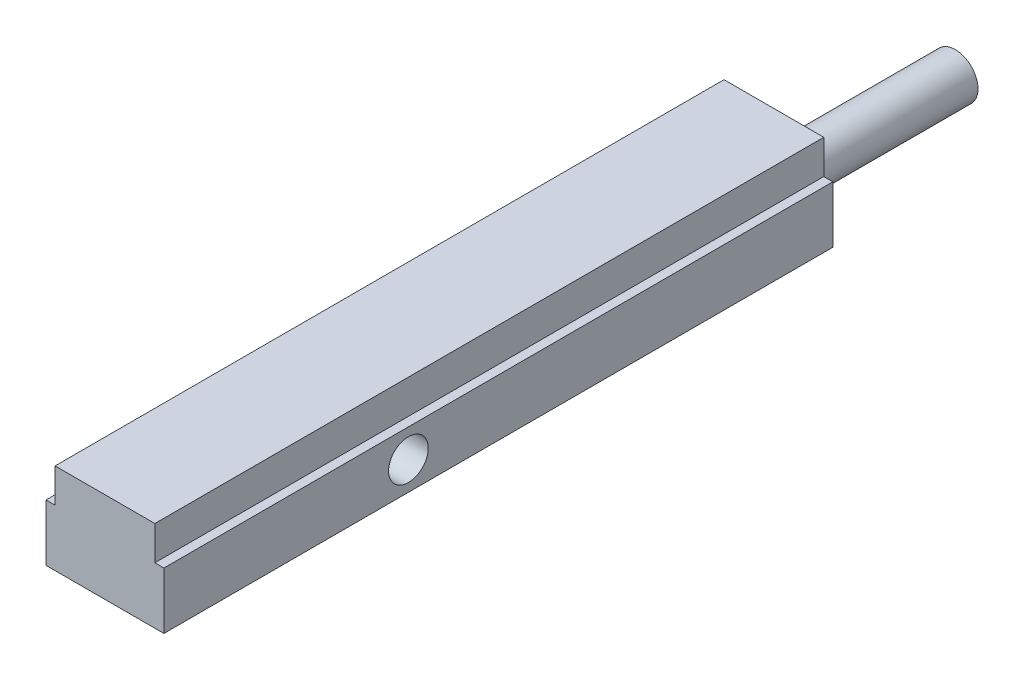
ISO-10303-21;
HEADER;
FILE_DESCRIPTION(('STEP AP214'),'2;1');
FILE_NAME('part.step','',(''),(''),'','','');
FILE_SCHEMA(('AUTOMOTIVE_DESIGN { 1 0 10303 214 1 1 1 1 }'));
ENDSEC;
DATA;
#1=APPLICATION_CONTEXT('core data for automotive mechanical design processes');
#2=APPLICATION_PROTOCOL_DEFINITION('international standard','automotive_design',2000,#1);
#3=PRODUCT_CONTEXT('',#1,'mechanical');
#4=PRODUCT('Part','Part','',(#3));
#5=PRODUCT_RELATED_PRODUCT_CATEGORY('part','',(#4));
#6=PRODUCT_DEFINITION_FORMATION('','',#4);
#7=PRODUCT_DEFINITION_CONTEXT('part definition',#1,'design');
#8=PRODUCT_DEFINITION('design','',#6,#7);
#9=PRODUCT_DEFINITION_SHAPE('','',#8);
#10=(LENGTH_UNIT() NAMED_UNIT(*) SI_UNIT(.MILLI.,.METRE.));
#11=(NAMED_UNIT(*) PLANE_ANGLE_UNIT() SI_UNIT($,.RADIAN.));
#12=(NAMED_UNIT(*) SI_UNIT($,.STERADIAN.) SOLID_ANGLE_UNIT());
#13=UNCERTAINTY_MEASURE_WITH_UNIT(LENGTH_MEASURE(1.E-05),#10,'distance_accuracy_value','');
#14=(GEOMETRIC_REPRESENTATION_CONTEXT(3) GLOBAL_UNCERTAINTY_ASSIGNED_CONTEXT((#13)) GLOBAL_UNIT_ASSIGNED_CONTEXT((#10,
#11,#12)) REPRESENTATION_CONTEXT('',''));
#15=CARTESIAN_POINT('',(0.,0.,0.));
#16=DIRECTION('',(0.,0.,1.));
#17=DIRECTION('',(1.,0.,0.));
#18=AXIS2_PLACEMENT_3D('',#15,#16,#17);
#19=CARTESIAN_POINT('',(-26.,0.,295.));
#20=DIRECTION('',(-1.,0.,0.));
#21=DIRECTION('',(0.,0.,1.));
#22=AXIS2_PLACEMENT_3D('',#19,#20,#21);
#23=PLANE('',#22);
#24=CARTESIAN_POINT('',(-26.,0.,187.17));
#25=DIRECTION('',(-1.,0.,0.));
#26=DIRECTION('',(0.,0.,1.));
#27=AXIS2_PLACEMENT_3D('',#24,#25,#26);
#28=CIRCLE('',#27,10.025);
#29=CARTESIAN_POINT('',(-26.,0.,197.195));
#30=VERTEX_POINT('',#29);
#31=EDGE_CURVE('E204',#30,#30,#28,.T.);
#32=ORIENTED_EDGE('',*,*,#31,.F.);
#33=EDGE_LOOP('',(#32));
#34=FACE_BOUND('',#33,.T.);
#35=DIRECTION('',(0.,1.,0.));
#36=VECTOR('',#35,1.);
#37=CARTESIAN_POINT('',(-26.,0.,0.));
#38=LINE('',#37,#36);
#39=CARTESIAN_POINT('',(-26.,-12.5,0.));
#40=VERTEX_POINT('',#39);
#41=CARTESIAN_POINT('',(-26.,12.5,0.));
#42=VERTEX_POINT('',#41);
#43=EDGE_CURVE('E133',#40,#42,#38,.T.);
#44=ORIENTED_EDGE('',*,*,#43,.F.);
#45=DIRECTION('',(0.,0.,-1.));
#46=VECTOR('',#45,1.);
#47=CARTESIAN_POINT('',(-26.,-12.5,295.));
#48=LINE('',#47,#46);
#49=CARTESIAN_POINT('',(-26.,-12.5,295.));
#50=VERTEX_POINT('',#49);
#51=EDGE_CURVE('E11',#50,#40,#48,.T.);
#52=ORIENTED_EDGE('',*,*,#51,.F.);
#53=DIRECTION('',(0.,1.,0.));
#54=VECTOR('',#53,1.);
#55=CARTESIAN_POINT('',(-26.,0.,295.));
#56=LINE('',#55,#54);
#57=CARTESIAN_POINT('',(-26.,12.5,295.));
#58=VERTEX_POINT('',#57);
#59=EDGE_CURVE('E174',#50,#58,#56,.T.);
#60=ORIENTED_EDGE('',*,*,#59,.T.);
#61=DIRECTION('',(0.,0.,-1.));
#62=VECTOR('',#61,1.);
#63=CARTESIAN_POINT('',(-26.,12.5,295.));
#64=LINE('',#63,#62);
#65=EDGE_CURVE('E89',#58,#42,#64,.T.);
#66=ORIENTED_EDGE('',*,*,#65,.T.);
#67=EDGE_LOOP('',(#44,#52,#60,#66));
#68=FACE_BOUND('',#67,.T.);
#69=ADVANCED_FACE('F39',(#34,#68),#23,.T.);
#70=CARTESIAN_POINT('',(0.,-12.5,295.));
#71=DIRECTION('',(0.,-1.,0.));
#72=DIRECTION('',(1.,0.,0.));
#73=AXIS2_PLACEMENT_3D('',#70,#71,#72);
#74=PLANE('',#73);
#75=DIRECTION('',(-1.,0.,0.));
#76=VECTOR('',#75,1.);
#77=CARTESIAN_POINT('',(0.,-12.5,0.));
#78=LINE('',#77,#76);
#79=CARTESIAN_POINT('',(26.,-12.5,0.));
#80=VERTEX_POINT('',#79);
#81=EDGE_CURVE('E136',#80,#40,#78,.T.);
#82=ORIENTED_EDGE('',*,*,#81,.F.);
#83=DIRECTION('',(0.,0.,-1.));
#84=VECTOR('',#83,1.);
#85=CARTESIAN_POINT('',(26.,-12.5,295.));
#86=LINE('',#85,#84);
#87=CARTESIAN_POINT('',(26.,-12.5,295.));
#88=VERTEX_POINT('',#87);
#89=EDGE_CURVE('E47',#88,#80,#86,.T.);
#90=ORIENTED_EDGE('',*,*,#89,.F.);
#91=DIRECTION('',(-1.,0.,0.));
#92=VECTOR('',#91,1.);
#93=CARTESIAN_POINT('',(0.,-12.5,295.));
#94=LINE('',#93,#92);
#95=EDGE_CURVE('E173',#88,#50,#94,.T.);
#96=ORIENTED_EDGE('',*,*,#95,.T.);
#97=ORIENTED_EDGE('',*,*,#51,.T.);
#98=EDGE_LOOP('',(#82,#90,#96,#97));
#99=FACE_BOUND('',#98,.T.);
#100=ADVANCED_FACE('F172',(#99),#74,.T.);
#101=CARTESIAN_POINT('',(26.,0.,295.));
#102=DIRECTION('',(-1.,0.,0.));
#103=DIRECTION('',(0.,0.,1.));
#104=AXIS2_PLACEMENT_3D('',#101,#102,#103);
#105=PLANE('',#104);
#106=CARTESIAN_POINT('',(26.,0.,187.17));
#107=DIRECTION('',(-1.,0.,0.));
#108=DIRECTION('',(0.,0.,1.));
#109=AXIS2_PLACEMENT_3D('',#106,#107,#108);
#110=CIRCLE('',#109,8.74999999999998);
#111=CARTESIAN_POINT('',(26.,0.,195.92));
#112=VERTEX_POINT('',#111);
#113=EDGE_CURVE('E209',#112,#112,#110,.T.);
#114=ORIENTED_EDGE('',*,*,#113,.T.);
#115=EDGE_LOOP('',(#114));
#116=FACE_BOUND('',#115,.T.);
#117=DIRECTION('',(0.,1.,0.));
#118=VECTOR('',#117,1.);
#119=CARTESIAN_POINT('',(26.,0.,0.));
#120=LINE('',#119,#118);
#121=CARTESIAN_POINT('',(26.,12.5,0.));
#122=VERTEX_POINT('',#121);
#123=EDGE_CURVE('E140',#80,#122,#120,.T.);
#124=ORIENTED_EDGE('',*,*,#123,.T.);
#125=DIRECTION('',(0.,0.,-1.));
#126=VECTOR('',#125,1.);
#127=CARTESIAN_POINT('',(26.,12.5,295.));
#128=LINE('',#127,#126);
#129=CARTESIAN_POINT('',(26.,12.5,295.));
#130=VERTEX_POINT('',#129);
#131=EDGE_CURVE('E156',#130,#122,#128,.T.);
#132=ORIENTED_EDGE('',*,*,#131,.F.);
#133=DIRECTION('',(0.,1.,0.));
#134=VECTOR('',#133,1.);
#135=CARTESIAN_POINT('',(26.,0.,295.));
#136=LINE('',#135,#134);
#137=EDGE_CURVE('E163',#88,#130,#136,.T.);
#138=ORIENTED_EDGE('',*,*,#137,.F.);
#139=ORIENTED_EDGE('',*,*,#89,.T.);
#140=EDGE_LOOP('',(#124,#132,#138,#139));
#141=FACE_BOUND('',#140,.T.);
#142=ADVANCED_FACE('F161',(#116,#141),#105,.F.);
#143=CARTESIAN_POINT('',(0.,12.5,295.));
#144=DIRECTION('',(0.,-1.,0.));
#145=DIRECTION('',(1.,0.,0.));
#146=AXIS2_PLACEMENT_3D('',#143,#144,#145);
#147=PLANE('',#146);
#148=DIRECTION('',(-1.,0.,0.));
#149=VECTOR('',#148,1.);
#150=CARTESIAN_POINT('',(0.,12.5,0.));
#151=LINE('',#150,#149);
#152=CARTESIAN_POINT('',(22.,12.5,0.));
#153=VERTEX_POINT('',#152);
#154=EDGE_CURVE('E142',#122,#153,#151,.T.);
#155=ORIENTED_EDGE('',*,*,#154,.T.);
#156=DIRECTION('',(0.,0.,-1.));
#157=VECTOR('',#156,1.);
#158=CARTESIAN_POINT('',(22.,12.5,295.));
#159=LINE('',#158,#157);
#160=CARTESIAN_POINT('',(22.,12.5,295.));
#161=VERTEX_POINT('',#160);
#162=EDGE_CURVE('E153',#161,#153,#159,.T.);
#163=ORIENTED_EDGE('',*,*,#162,.F.);
#164=DIRECTION('',(-1.,0.,0.));
#165=VECTOR('',#164,1.);
#166=CARTESIAN_POINT('',(0.,12.5,295.));
#167=LINE('',#166,#165);
#168=EDGE_CURVE('E130',#130,#161,#167,.T.);
#169=ORIENTED_EDGE('',*,*,#168,.F.);
#170=ORIENTED_EDGE('',*,*,#131,.T.);
#171=EDGE_LOOP('',(#155,#163,#169,#170));
#172=FACE_BOUND('',#171,.T.);
#173=ADVANCED_FACE('F184',(#172),#147,.F.);
#174=CARTESIAN_POINT('',(22.,0.,295.));
#175=DIRECTION('',(-1.,0.,0.));
#176=DIRECTION('',(0.,0.,1.));
#177=AXIS2_PLACEMENT_3D('',#174,#175,#176);
#178=PLANE('',#177);
#179=DIRECTION('',(0.,1.,0.));
#180=VECTOR('',#179,1.);
#181=CARTESIAN_POINT('',(22.,0.,0.));
#182=LINE('',#181,#180);
#183=CARTESIAN_POINT('',(22.,27.5,0.));
#184=VERTEX_POINT('',#183);
#185=EDGE_CURVE('E144',#153,#184,#182,.T.);
#186=ORIENTED_EDGE('',*,*,#185,.T.);
#187=DIRECTION('',(0.,0.,-1.));
#188=VECTOR('',#187,1.);
#189=CARTESIAN_POINT('',(22.,27.5,295.));
#190=LINE('',#189,#188);
#191=CARTESIAN_POINT('',(22.,27.5,295.));
#192=VERTEX_POINT('',#191);
#193=EDGE_CURVE('E125',#192,#184,#190,.T.);
#194=ORIENTED_EDGE('',*,*,#193,.F.);
#195=DIRECTION('',(0.,1.,0.));
#196=VECTOR('',#195,1.);
#197=CARTESIAN_POINT('',(22.,0.,295.));
#198=LINE('',#197,#196);
#199=EDGE_CURVE('E112',#161,#192,#198,.T.);
#200=ORIENTED_EDGE('',*,*,#199,.F.);
#201=ORIENTED_EDGE('',*,*,#162,.T.);
#202=EDGE_LOOP('',(#186,#194,#200,#201));
#203=FACE_BOUND('',#202,.T.);
#204=ADVANCED_FACE('F186',(#203),#178,.F.);
#205=CARTESIAN_POINT('',(0.,27.5,295.));
#206=DIRECTION('',(0.,-1.,0.));
#207=DIRECTION('',(0.,0.,-1.));
#208=AXIS2_PLACEMENT_3D('',#205,#206,#207);
#209=PLANE('',#208);
#210=DIRECTION('',(-1.,0.,0.));
#211=VECTOR('',#210,1.);
#212=CARTESIAN_POINT('',(0.,27.5,0.));
#213=LINE('',#212,#211);
#214=CARTESIAN_POINT('',(-22.,27.5,0.));
#215=VERTEX_POINT('',#214);
#216=EDGE_CURVE('E121',#184,#215,#213,.T.);
#217=ORIENTED_EDGE('',*,*,#216,.T.);
#218=DIRECTION('',(0.,0.,-1.));
#219=VECTOR('',#218,1.);
#220=CARTESIAN_POINT('',(-22.,27.5,295.));
#221=LINE('',#220,#219);
#222=CARTESIAN_POINT('',(-22.,27.5,295.));
#223=VERTEX_POINT('',#222);
#224=EDGE_CURVE('E118',#223,#215,#221,.T.);
#225=ORIENTED_EDGE('',*,*,#224,.F.);
#226=DIRECTION('',(-1.,0.,0.));
#227=VECTOR('',#226,1.);
#228=CARTESIAN_POINT('',(0.,27.5,295.));
#229=LINE('',#228,#227);
#230=EDGE_CURVE('E106',#192,#223,#229,.T.);
#231=ORIENTED_EDGE('',*,*,#230,.F.);
#232=ORIENTED_EDGE('',*,*,#193,.T.);
#233=EDGE_LOOP('',(#217,#225,#231,#232));
#234=FACE_BOUND('',#233,.T.);
#235=ADVANCED_FACE('F119',(#234),#209,.F.);
#236=CARTESIAN_POINT('',(-22.,0.,295.));
#237=DIRECTION('',(-1.,0.,0.));
#238=DIRECTION('',(0.,0.,1.));
#239=AXIS2_PLACEMENT_3D('',#236,#237,#238);
#240=PLANE('',#239);
#241=DIRECTION('',(0.,1.,0.));
#242=VECTOR('',#241,1.);
#243=CARTESIAN_POINT('',(-22.,0.,0.));
#244=LINE('',#243,#242);
#245=CARTESIAN_POINT('',(-22.,12.5,0.));
#246=VERTEX_POINT('',#245);
#247=EDGE_CURVE('E148',#246,#215,#244,.T.);
#248=ORIENTED_EDGE('',*,*,#247,.F.);
#249=DIRECTION('',(0.,0.,-1.));
#250=VECTOR('',#249,1.);
#251=CARTESIAN_POINT('',(-22.,12.5,295.));
#252=LINE('',#251,#250);
#253=CARTESIAN_POINT('',(-22.,12.5,295.));
#254=VERTEX_POINT('',#253);
#255=EDGE_CURVE('E82',#254,#246,#252,.T.);
#256=ORIENTED_EDGE('',*,*,#255,.F.);
#257=DIRECTION('',(0.,1.,0.));
#258=VECTOR('',#257,1.);
#259=CARTESIAN_POINT('',(-22.,0.,295.));
#260=LINE('',#259,#258);
#261=EDGE_CURVE('E110',#254,#223,#260,.T.);
#262=ORIENTED_EDGE('',*,*,#261,.T.);
#263=ORIENTED_EDGE('',*,*,#224,.T.);
#264=EDGE_LOOP('',(#248,#256,#262,#263));
#265=FACE_BOUND('',#264,.T.);
#266=ADVANCED_FACE('F127',(#265),#240,.T.);
#267=EDGE_CURVE('E145',#246,#42,#151,.T.);
#268=ORIENTED_EDGE('',*,*,#267,.T.);
#269=ORIENTED_EDGE('',*,*,#65,.F.);
#270=EDGE_CURVE('E55',#254,#58,#167,.T.);
#271=ORIENTED_EDGE('',*,*,#270,.F.);
#272=ORIENTED_EDGE('',*,*,#255,.T.);
#273=EDGE_LOOP('',(#268,#269,#271,#272));
#274=FACE_BOUND('',#273,.T.);
#275=ADVANCED_FACE('F195',(#274),#147,.F.);
#276=CARTESIAN_POINT('',(0.,0.,295.));
#277=DIRECTION('',(0.,0.,1.));
#278=DIRECTION('',(1.,0.,0.));
#279=AXIS2_PLACEMENT_3D('',#276,#277,#278);
#280=PLANE('',#279);
#281=ORIENTED_EDGE('',*,*,#59,.F.);
#282=ORIENTED_EDGE('',*,*,#95,.F.);
#283=ORIENTED_EDGE('',*,*,#137,.T.);
#284=ORIENTED_EDGE('',*,*,#168,.T.);
#285=ORIENTED_EDGE('',*,*,#199,.T.);
#286=ORIENTED_EDGE('',*,*,#230,.T.);
#287=ORIENTED_EDGE('',*,*,#261,.F.);
#288=ORIENTED_EDGE('',*,*,#270,.T.);
#289=EDGE_LOOP('',(#281,#282,#283,#284,#285,#286,#287,#288));
#290=FACE_BOUND('',#289,.T.);
#291=ADVANCED_FACE('F108',(#290),#280,.T.);
#292=CARTESIAN_POINT('',(0.,0.,0.));
#293=DIRECTION('',(0.,0.,1.));
#294=DIRECTION('',(1.,0.,0.));
#295=AXIS2_PLACEMENT_3D('',#292,#293,#294);
#296=PLANE('',#295);
#297=CARTESIAN_POINT('',(0.,0.,0.));
#298=DIRECTION('',(0.,0.,1.));
#299=DIRECTION('',(1.,0.,0.));
#300=AXIS2_PLACEMENT_3D('',#297,#298,#299);
#301=CIRCLE('',#300,10.);
#302=CARTESIAN_POINT('',(10.,0.,0.));
#303=VERTEX_POINT('',#302);
#304=EDGE_CURVE('E178',#303,#303,#301,.T.);
#305=ORIENTED_EDGE('',*,*,#304,.T.);
#306=EDGE_LOOP('',(#305));
#307=FACE_BOUND('',#306,.T.);
#308=ORIENTED_EDGE('',*,*,#43,.T.);
#309=ORIENTED_EDGE('',*,*,#267,.F.);
#310=ORIENTED_EDGE('',*,*,#247,.T.);
#311=ORIENTED_EDGE('',*,*,#216,.F.);
#312=ORIENTED_EDGE('',*,*,#185,.F.);
#313=ORIENTED_EDGE('',*,*,#154,.F.);
#314=ORIENTED_EDGE('',*,*,#123,.F.);
#315=ORIENTED_EDGE('',*,*,#81,.T.);
#316=EDGE_LOOP('',(#308,#309,#310,#311,#312,#313,#314,#315));
#317=FACE_BOUND('',#316,.T.);
#318=ADVANCED_FACE('F170',(#307,#317),#296,.F.);
#319=CARTESIAN_POINT('',(0.,0.,-80.));
#320=DIRECTION('',(0.,0.,1.));
#321=DIRECTION('',(1.,0.,0.));
#322=AXIS2_PLACEMENT_3D('',#319,#320,#321);
#323=CYLINDRICAL_SURFACE('',#322,10.);
#324=CARTESIAN_POINT('',(0.,0.,-80.));
#325=DIRECTION('',(0.,0.,1.));
#326=DIRECTION('',(1.,0.,0.));
#327=AXIS2_PLACEMENT_3D('',#324,#325,#326);
#328=CIRCLE('',#327,10.);
#329=CARTESIAN_POINT('',(10.,0.,-80.));
#330=VERTEX_POINT('',#329);
#331=EDGE_CURVE('E137',#330,#330,#328,.T.);
#332=ORIENTED_EDGE('',*,*,#331,.T.);
#333=EDGE_LOOP('',(#332));
#334=FACE_BOUND('',#333,.T.);
#335=ORIENTED_EDGE('',*,*,#304,.F.);
#336=EDGE_LOOP('',(#335));
#337=FACE_BOUND('',#336,.T.);
#338=ADVANCED_FACE('F220',(#334,#337),#323,.T.);
#339=CARTESIAN_POINT('',(0.,0.,-80.));
#340=DIRECTION('',(0.,0.,1.));
#341=DIRECTION('',(1.,0.,0.));
#342=AXIS2_PLACEMENT_3D('',#339,#340,#341);
#343=PLANE('',#342);
#344=ORIENTED_EDGE('',*,*,#331,.F.);
#345=EDGE_LOOP('',(#344));
#346=FACE_BOUND('',#345,.T.);
#347=ADVANCED_FACE('F222',(#346),#343,.F.);
#348=CARTESIAN_POINT('',(-26.,0.,187.17));
#349=DIRECTION('',(-1.,0.,0.));
#350=DIRECTION('',(0.,0.,1.));
#351=AXIS2_PLACEMENT_3D('',#348,#349,#350);
#352=CYLINDRICAL_SURFACE('',#351,8.74999999999998);
#353=ORIENTED_EDGE('',*,*,#113,.F.);
#354=EDGE_LOOP('',(#353));
#355=FACE_BOUND('',#354,.T.);
#356=CARTESIAN_POINT('',(-24.725,0.,187.17));
#357=DIRECTION('',(-1.,0.,0.));
#358=DIRECTION('',(0.,0.,1.));
#359=AXIS2_PLACEMENT_3D('',#356,#357,#358);
#360=CIRCLE('',#359,8.74999999999999);
#361=CARTESIAN_POINT('',(-24.725,0.,195.92));
#362=VERTEX_POINT('',#361);
#363=EDGE_CURVE('E206',#362,#362,#360,.T.);
#364=ORIENTED_EDGE('',*,*,#363,.T.);
#365=EDGE_LOOP('',(#364));
#366=FACE_BOUND('',#365,.T.);
#367=ADVANCED_FACE('F228',(#355,#366),#352,.F.);
#368=CARTESIAN_POINT('',(-26.,0.,187.17));
#369=DIRECTION('',(-1.,0.,0.));
#370=DIRECTION('',(0.,0.,1.));
#371=AXIS2_PLACEMENT_3D('',#368,#369,#370);
#372=CONICAL_SURFACE('',#371,10.025,0.785398163397444);
#373=ORIENTED_EDGE('',*,*,#363,.F.);
#374=EDGE_LOOP('',(#373));
#375=FACE_BOUND('',#374,.T.);
#376=ORIENTED_EDGE('',*,*,#31,.T.);
#377=EDGE_LOOP('',(#376));
#378=FACE_BOUND('',#377,.T.);
#379=ADVANCED_FACE('F294',(#375,#378),#372,.F.);
#380=CLOSED_SHELL('',(#69,#100,#142,#173,#204,#235,#266,#275,#291,#318,#338,#347,#367,#379));
#381=MANIFOLD_SOLID_BREP('B2',#380);
#382=ADVANCED_BREP_SHAPE_REPRESENTATION('',(#18,#381),#14);
#383=SHAPE_DEFINITION_REPRESENTATION(#9,#382);
ENDSEC;
END-ISO-10303-21;
